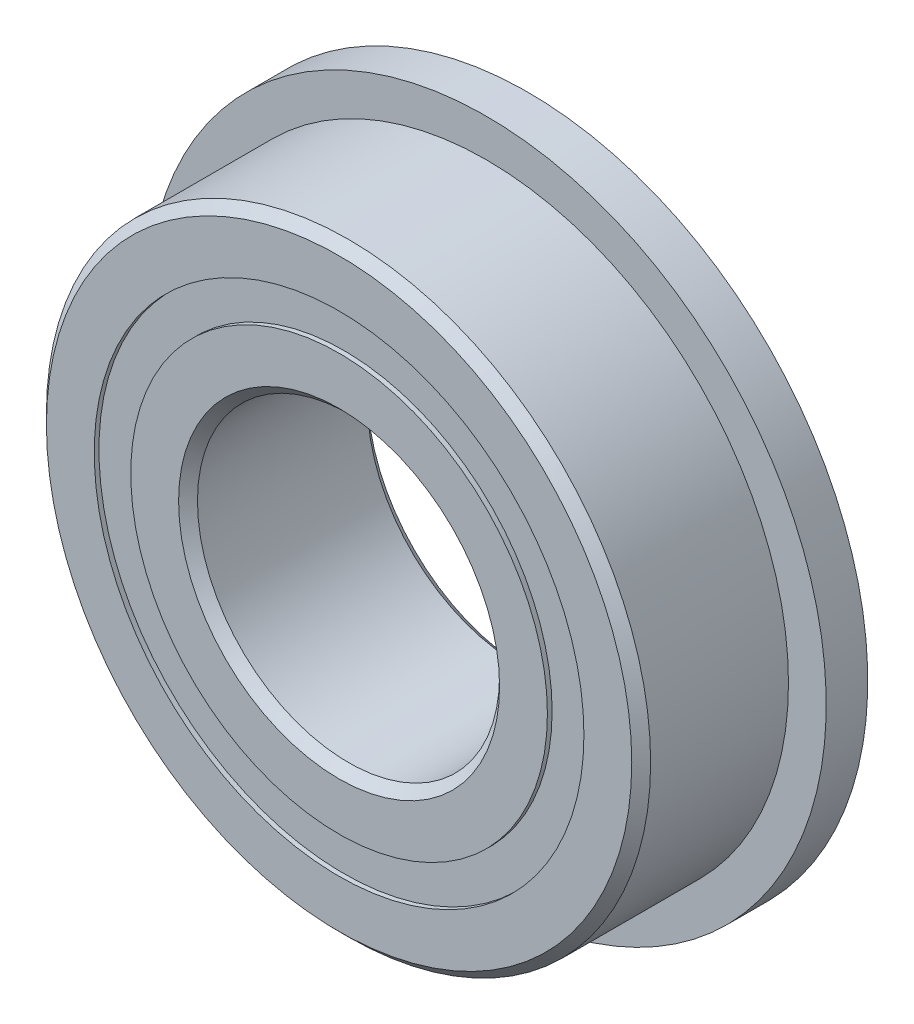
ISO-10303-21;
HEADER;
FILE_DESCRIPTION(('STEP AP214'),'2;1');
FILE_NAME('part.step','',(''),(''),'','','');
FILE_SCHEMA(('AUTOMOTIVE_DESIGN { 1 0 10303 214 1 1 1 1 }'));
ENDSEC;
DATA;
#1=APPLICATION_CONTEXT('core data for automotive mechanical design processes');
#2=APPLICATION_PROTOCOL_DEFINITION('international standard','automotive_design',2000,#1);
#3=PRODUCT_CONTEXT('',#1,'mechanical');
#4=PRODUCT('Part','Part','',(#3));
#5=PRODUCT_RELATED_PRODUCT_CATEGORY('part','',(#4));
#6=PRODUCT_DEFINITION_FORMATION('','',#4);
#7=PRODUCT_DEFINITION_CONTEXT('part definition',#1,'design');
#8=PRODUCT_DEFINITION('design','',#6,#7);
#9=PRODUCT_DEFINITION_SHAPE('','',#8);
#10=(LENGTH_UNIT() NAMED_UNIT(*) SI_UNIT(.MILLI.,.METRE.));
#11=(NAMED_UNIT(*) PLANE_ANGLE_UNIT() SI_UNIT($,.RADIAN.));
#12=(NAMED_UNIT(*) SI_UNIT($,.STERADIAN.) SOLID_ANGLE_UNIT());
#13=UNCERTAINTY_MEASURE_WITH_UNIT(LENGTH_MEASURE(1.E-05),#10,'distance_accuracy_value','');
#14=(GEOMETRIC_REPRESENTATION_CONTEXT(3) GLOBAL_UNCERTAINTY_ASSIGNED_CONTEXT((#13)) GLOBAL_UNIT_ASSIGNED_CONTEXT((#10,
#11,#12)) REPRESENTATION_CONTEXT('',''));
#15=CARTESIAN_POINT('',(0.,0.,0.));
#16=DIRECTION('',(0.,0.,1.));
#17=DIRECTION('',(1.,0.,0.));
#18=AXIS2_PLACEMENT_3D('',#15,#16,#17);
#19=CARTESIAN_POINT('',(0.,6.48351648351649,-2.375));
#20=DIRECTION('',(0.,0.,1.));
#21=DIRECTION('',(1.,0.,0.));
#22=AXIS2_PLACEMENT_3D('',#19,#20,#21);
#23=PLANE('',#22);
#24=CARTESIAN_POINT('',(0.,0.,-2.375));
#25=DIRECTION('',(0.,0.,1.));
#26=DIRECTION('',(1.,0.,0.));
#27=AXIS2_PLACEMENT_3D('',#24,#25,#26);
#28=CIRCLE('',#27,6.48351648351649);
#29=CARTESIAN_POINT('',(6.48351648351649,0.,-2.375));
#30=VERTEX_POINT('',#29);
#31=EDGE_CURVE('E63',#30,#30,#28,.T.);
#32=ORIENTED_EDGE('',*,*,#31,.F.);
#33=EDGE_LOOP('',(#32));
#34=FACE_BOUND('',#33,.T.);
#35=CARTESIAN_POINT('',(0.,0.,-2.375));
#36=DIRECTION('',(0.,0.,1.));
#37=DIRECTION('',(1.,0.,0.));
#38=AXIS2_PLACEMENT_3D('',#35,#36,#37);
#39=CIRCLE('',#38,5.51648351648352);
#40=CARTESIAN_POINT('',(5.51648351648352,0.,-2.375));
#41=VERTEX_POINT('',#40);
#42=EDGE_CURVE('E11',#41,#41,#39,.T.);
#43=ORIENTED_EDGE('',*,*,#42,.T.);
#44=EDGE_LOOP('',(#43));
#45=FACE_BOUND('',#44,.T.);
#46=ADVANCED_FACE('F49',(#34,#45),#23,.F.);
#47=CARTESIAN_POINT('',(0.,0.,2.5));
#48=DIRECTION('',(0.,0.,1.));
#49=DIRECTION('',(1.,0.,0.));
#50=AXIS2_PLACEMENT_3D('',#47,#48,#49);
#51=CYLINDRICAL_SURFACE('',#50,5.51648351648352);
#52=ORIENTED_EDGE('',*,*,#42,.F.);
#53=EDGE_LOOP('',(#52));
#54=FACE_BOUND('',#53,.T.);
#55=CARTESIAN_POINT('',(0.,0.,-1.21175743903915));
#56=DIRECTION('',(0.,0.,1.));
#57=DIRECTION('',(1.,0.,0.));
#58=AXIS2_PLACEMENT_3D('',#55,#56,#57);
#59=CIRCLE('',#58,5.51648351648352);
#60=CARTESIAN_POINT('',(5.51648351648352,0.,-1.21175743903915));
#61=VERTEX_POINT('',#60);
#62=EDGE_CURVE('E55',#61,#61,#59,.T.);
#63=ORIENTED_EDGE('',*,*,#62,.T.);
#64=EDGE_LOOP('',(#63));
#65=FACE_BOUND('',#64,.T.);
#66=ADVANCED_FACE('F72',(#54,#65),#51,.F.);
#67=CARTESIAN_POINT('',(0.,6.48351648351648,-1.21175743903915));
#68=DIRECTION('',(0.,0.,-1.));
#69=DIRECTION('',(-1.,0.,0.));
#70=AXIS2_PLACEMENT_3D('',#67,#68,#69);
#71=PLANE('',#70);
#72=ORIENTED_EDGE('',*,*,#62,.F.);
#73=EDGE_LOOP('',(#72));
#74=FACE_BOUND('',#73,.T.);
#75=CARTESIAN_POINT('',(0.,0.,-1.21175743903915));
#76=DIRECTION('',(0.,0.,1.));
#77=DIRECTION('',(1.,0.,0.));
#78=AXIS2_PLACEMENT_3D('',#75,#76,#77);
#79=CIRCLE('',#78,6.48351648351648);
#80=CARTESIAN_POINT('',(6.48351648351648,0.,-1.21175743903915));
#81=VERTEX_POINT('',#80);
#82=EDGE_CURVE('E59',#81,#81,#79,.T.);
#83=ORIENTED_EDGE('',*,*,#82,.T.);
#84=EDGE_LOOP('',(#83));
#85=FACE_BOUND('',#84,.T.);
#86=ADVANCED_FACE('F76',(#74,#85),#71,.F.);
#87=CARTESIAN_POINT('',(0.,0.,2.5));
#88=DIRECTION('',(0.,0.,1.));
#89=DIRECTION('',(1.,0.,0.));
#90=AXIS2_PLACEMENT_3D('',#87,#88,#89);
#91=CYLINDRICAL_SURFACE('',#90,6.48351648351649);
#92=ORIENTED_EDGE('',*,*,#82,.F.);
#93=EDGE_LOOP('',(#92));
#94=FACE_BOUND('',#93,.T.);
#95=ORIENTED_EDGE('',*,*,#31,.T.);
#96=EDGE_LOOP('',(#95));
#97=FACE_BOUND('',#96,.T.);
#98=ADVANCED_FACE('F69',(#94,#97),#91,.T.);
#99=CLOSED_SHELL('',(#46,#66,#86,#98));
#100=MANIFOLD_SOLID_BREP('B2',#99);
#101=CARTESIAN_POINT('',(0.,6.48351648351648,2.375));
#102=DIRECTION('',(0.,0.,-1.));
#103=DIRECTION('',(-1.,0.,0.));
#104=AXIS2_PLACEMENT_3D('',#101,#102,#103);
#105=PLANE('',#104);
#106=CARTESIAN_POINT('',(0.,0.,2.375));
#107=DIRECTION('',(0.,0.,1.));
#108=DIRECTION('',(1.,0.,0.));
#109=AXIS2_PLACEMENT_3D('',#106,#107,#108);
#110=CIRCLE('',#109,5.51648351648352);
#111=CARTESIAN_POINT('',(5.51648351648352,0.,2.375));
#112=VERTEX_POINT('',#111);
#113=EDGE_CURVE('E48',#112,#112,#110,.T.);
#114=ORIENTED_EDGE('',*,*,#113,.F.);
#115=EDGE_LOOP('',(#114));
#116=FACE_BOUND('',#115,.T.);
#117=CARTESIAN_POINT('',(0.,0.,2.375));
#118=DIRECTION('',(0.,0.,1.));
#119=DIRECTION('',(1.,0.,0.));
#120=AXIS2_PLACEMENT_3D('',#117,#118,#119);
#121=CIRCLE('',#120,6.48351648351648);
#122=CARTESIAN_POINT('',(6.48351648351648,0.,2.375));
#123=VERTEX_POINT('',#122);
#124=EDGE_CURVE('E136',#123,#123,#121,.T.);
#125=ORIENTED_EDGE('',*,*,#124,.T.);
#126=EDGE_LOOP('',(#125));
#127=FACE_BOUND('',#126,.T.);
#128=ADVANCED_FACE('F122',(#116,#127),#105,.F.);
#129=CARTESIAN_POINT('',(0.,0.,2.5));
#130=DIRECTION('',(0.,0.,1.));
#131=DIRECTION('',(1.,0.,0.));
#132=AXIS2_PLACEMENT_3D('',#129,#130,#131);
#133=CYLINDRICAL_SURFACE('',#132,5.51648351648352);
#134=CARTESIAN_POINT('',(0.,0.,1.21175743903915));
#135=DIRECTION('',(0.,0.,1.));
#136=DIRECTION('',(1.,0.,0.));
#137=AXIS2_PLACEMENT_3D('',#134,#135,#136);
#138=CIRCLE('',#137,5.51648351648352);
#139=CARTESIAN_POINT('',(5.51648351648352,0.,1.21175743903915));
#140=VERTEX_POINT('',#139);
#141=EDGE_CURVE('E128',#140,#140,#138,.T.);
#142=ORIENTED_EDGE('',*,*,#141,.F.);
#143=EDGE_LOOP('',(#142));
#144=FACE_BOUND('',#143,.T.);
#145=ORIENTED_EDGE('',*,*,#113,.T.);
#146=EDGE_LOOP('',(#145));
#147=FACE_BOUND('',#146,.T.);
#148=ADVANCED_FACE('F151',(#144,#147),#133,.F.);
#149=CARTESIAN_POINT('',(0.,6.48351648351648,1.21175743903915));
#150=DIRECTION('',(0.,0.,1.));
#151=DIRECTION('',(1.,0.,0.));
#152=AXIS2_PLACEMENT_3D('',#149,#150,#151);
#153=PLANE('',#152);
#154=CARTESIAN_POINT('',(0.,0.,1.21175743903915));
#155=DIRECTION('',(0.,0.,1.));
#156=DIRECTION('',(1.,0.,0.));
#157=AXIS2_PLACEMENT_3D('',#154,#155,#156);
#158=CIRCLE('',#157,6.48351648351648);
#159=CARTESIAN_POINT('',(6.48351648351648,0.,1.21175743903915));
#160=VERTEX_POINT('',#159);
#161=EDGE_CURVE('E132',#160,#160,#158,.T.);
#162=ORIENTED_EDGE('',*,*,#161,.F.);
#163=EDGE_LOOP('',(#162));
#164=FACE_BOUND('',#163,.T.);
#165=ORIENTED_EDGE('',*,*,#141,.T.);
#166=EDGE_LOOP('',(#165));
#167=FACE_BOUND('',#166,.T.);
#168=ADVANCED_FACE('F146',(#164,#167),#153,.F.);
#169=CARTESIAN_POINT('',(0.,0.,2.5));
#170=DIRECTION('',(0.,0.,1.));
#171=DIRECTION('',(1.,0.,0.));
#172=AXIS2_PLACEMENT_3D('',#169,#170,#171);
#173=CYLINDRICAL_SURFACE('',#172,6.48351648351648);
#174=ORIENTED_EDGE('',*,*,#124,.F.);
#175=EDGE_LOOP('',(#174));
#176=FACE_BOUND('',#175,.T.);
#177=ORIENTED_EDGE('',*,*,#161,.T.);
#178=EDGE_LOOP('',(#177));
#179=FACE_BOUND('',#178,.T.);
#180=ADVANCED_FACE('F143',(#176,#179),#173,.T.);
#181=CLOSED_SHELL('',(#128,#148,#168,#180));
#182=MANIFOLD_SOLID_BREP('B6',#181);
#183=CARTESIAN_POINT('',(-2.99999999999993,5.19615242270667,0.));
#184=DIRECTION('',(0.,0.,1.));
#185=DIRECTION('',(-0.499999999999989,0.866025403784445,0.));
#186=AXIS2_PLACEMENT_3D('',#183,#184,#185);
#187=SPHERICAL_SURFACE('',#186,1.21175743903915);
#188=CARTESIAN_POINT('',(-2.99999999999993,5.19615242270667,1.21175743903915));
#189=VERTEX_POINT('',#188);
#190=VERTEX_LOOP('',#189);
#191=FACE_BOUND('',#190,.T.);
#192=ADVANCED_FACE('F189',(#191),#187,.T.);
#193=CLOSED_SHELL('',(#192));
#194=MANIFOLD_SOLID_BREP('B43',#193);
#195=CARTESIAN_POINT('',(-5.1961524227066,3.00000000000006,0.));
#196=DIRECTION('',(0.,0.,1.));
#197=DIRECTION('',(-0.866025403784433,0.50000000000001,0.));
#198=AXIS2_PLACEMENT_3D('',#195,#196,#197);
#199=SPHERICAL_SURFACE('',#198,1.21175743903915);
#200=CARTESIAN_POINT('',(-5.1961524227066,3.00000000000006,1.21175743903915));
#201=VERTEX_POINT('',#200);
#202=VERTEX_LOOP('',#201);
#203=FACE_BOUND('',#202,.T.);
#204=ADVANCED_FACE('F209',(#203),#199,.T.);
#205=CLOSED_SHELL('',(#204));
#206=MANIFOLD_SOLID_BREP('B118',#205);
#207=CARTESIAN_POINT('',(-6.,0.,0.));
#208=DIRECTION('',(0.,0.,1.));
#209=DIRECTION('',(-1.,0.,0.));
#210=AXIS2_PLACEMENT_3D('',#207,#208,#209);
#211=SPHERICAL_SURFACE('',#210,1.21175743903915);
#212=CARTESIAN_POINT('',(-6.,0.,1.21175743903915));
#213=VERTEX_POINT('',#212);
#214=VERTEX_LOOP('',#213);
#215=FACE_BOUND('',#214,.T.);
#216=ADVANCED_FACE('F229',(#215),#211,.T.);
#217=CLOSED_SHELL('',(#216));
#218=MANIFOLD_SOLID_BREP('B185',#217);
#219=CARTESIAN_POINT('',(-5.19615242270666,-2.99999999999995,0.));
#220=DIRECTION('',(0.,0.,1.));
#221=DIRECTION('',(-0.866025403784443,-0.499999999999992,0.));
#222=AXIS2_PLACEMENT_3D('',#219,#220,#221);
#223=SPHERICAL_SURFACE('',#222,1.21175743903915);
#224=CARTESIAN_POINT('',(-5.19615242270666,-2.99999999999995,1.21175743903915));
#225=VERTEX_POINT('',#224);
#226=VERTEX_LOOP('',#225);
#227=FACE_BOUND('',#226,.T.);
#228=ADVANCED_FACE('F249',(#227),#223,.T.);
#229=CLOSED_SHELL('',(#228));
#230=MANIFOLD_SOLID_BREP('B205',#229);
#231=CARTESIAN_POINT('',(-3.00000000000004,-5.19615242270661,0.));
#232=DIRECTION('',(0.,0.,1.));
#233=DIRECTION('',(-0.500000000000007,-0.866025403784435,0.));
#234=AXIS2_PLACEMENT_3D('',#231,#232,#233);
#235=SPHERICAL_SURFACE('',#234,1.21175743903915);
#236=CARTESIAN_POINT('',(-3.00000000000004,-5.19615242270661,1.21175743903915));
#237=VERTEX_POINT('',#236);
#238=VERTEX_LOOP('',#237);
#239=FACE_BOUND('',#238,.T.);
#240=ADVANCED_FACE('F269',(#239),#235,.T.);
#241=CLOSED_SHELL('',(#240));
#242=MANIFOLD_SOLID_BREP('B225',#241);
#243=CARTESIAN_POINT('',(0.,-6.,0.));
#244=DIRECTION('',(0.,0.,1.));
#245=DIRECTION('',(0.,-1.,0.));
#246=AXIS2_PLACEMENT_3D('',#243,#244,#245);
#247=SPHERICAL_SURFACE('',#246,1.21175743903915);
#248=CARTESIAN_POINT('',(0.,-6.,1.21175743903915));
#249=VERTEX_POINT('',#248);
#250=VERTEX_LOOP('',#249);
#251=FACE_BOUND('',#250,.T.);
#252=ADVANCED_FACE('F289',(#251),#247,.T.);
#253=CLOSED_SHELL('',(#252));
#254=MANIFOLD_SOLID_BREP('B245',#253);
#255=CARTESIAN_POINT('',(2.99999999999997,-5.19615242270665,0.));
#256=DIRECTION('',(0.,0.,1.));
#257=DIRECTION('',(0.499999999999995,-0.866025403784442,0.));
#258=AXIS2_PLACEMENT_3D('',#255,#256,#257);
#259=SPHERICAL_SURFACE('',#258,1.21175743903915);
#260=CARTESIAN_POINT('',(2.99999999999997,-5.19615242270665,1.21175743903915));
#261=VERTEX_POINT('',#260);
#262=VERTEX_LOOP('',#261);
#263=FACE_BOUND('',#262,.T.);
#264=ADVANCED_FACE('F309',(#263),#259,.T.);
#265=CLOSED_SHELL('',(#264));
#266=MANIFOLD_SOLID_BREP('B265',#265);
#267=CARTESIAN_POINT('',(5.19615242270662,-3.00000000000002,0.));
#268=DIRECTION('',(0.,0.,1.));
#269=DIRECTION('',(0.866025403784436,-0.500000000000004,0.));
#270=AXIS2_PLACEMENT_3D('',#267,#268,#269);
#271=SPHERICAL_SURFACE('',#270,1.21175743903915);
#272=CARTESIAN_POINT('',(5.19615242270662,-3.00000000000002,1.21175743903915));
#273=VERTEX_POINT('',#272);
#274=VERTEX_LOOP('',#273);
#275=FACE_BOUND('',#274,.T.);
#276=ADVANCED_FACE('F329',(#275),#271,.T.);
#277=CLOSED_SHELL('',(#276));
#278=MANIFOLD_SOLID_BREP('B285',#277);
#279=CARTESIAN_POINT('',(6.,0.,0.));
#280=DIRECTION('',(0.,0.,1.));
#281=DIRECTION('',(1.,0.,0.));
#282=AXIS2_PLACEMENT_3D('',#279,#280,#281);
#283=SPHERICAL_SURFACE('',#282,1.21175743903915);
#284=CARTESIAN_POINT('',(6.,0.,1.21175743903915));
#285=VERTEX_POINT('',#284);
#286=VERTEX_LOOP('',#285);
#287=FACE_BOUND('',#286,.T.);
#288=ADVANCED_FACE('F349',(#287),#283,.T.);
#289=CLOSED_SHELL('',(#288));
#290=MANIFOLD_SOLID_BREP('B305',#289);
#291=CARTESIAN_POINT('',(5.19615242270664,2.99999999999999,0.));
#292=DIRECTION('',(0.,0.,1.));
#293=DIRECTION('',(0.86602540378444,0.499999999999998,0.));
#294=AXIS2_PLACEMENT_3D('',#291,#292,#293);
#295=SPHERICAL_SURFACE('',#294,1.21175743903915);
#296=CARTESIAN_POINT('',(5.19615242270664,2.99999999999999,1.21175743903915));
#297=VERTEX_POINT('',#296);
#298=VERTEX_LOOP('',#297);
#299=FACE_BOUND('',#298,.T.);
#300=ADVANCED_FACE('F369',(#299),#295,.T.);
#301=CLOSED_SHELL('',(#300));
#302=MANIFOLD_SOLID_BREP('B325',#301);
#303=CARTESIAN_POINT('',(3.00000000000001,5.19615242270663,0.));
#304=DIRECTION('',(0.,0.,1.));
#305=DIRECTION('',(0.500000000000001,0.866025403784438,0.));
#306=AXIS2_PLACEMENT_3D('',#303,#304,#305);
#307=SPHERICAL_SURFACE('',#306,1.21175743903915);
#308=CARTESIAN_POINT('',(3.00000000000001,5.19615242270663,1.21175743903915));
#309=VERTEX_POINT('',#308);
#310=VERTEX_LOOP('',#309);
#311=FACE_BOUND('',#310,.T.);
#312=ADVANCED_FACE('F389',(#311),#307,.T.);
#313=CLOSED_SHELL('',(#312));
#314=MANIFOLD_SOLID_BREP('B345',#313);
#315=CARTESIAN_POINT('',(0.,6.,0.));
#316=DIRECTION('',(0.,0.,1.));
#317=DIRECTION('',(0.,1.,0.));
#318=AXIS2_PLACEMENT_3D('',#315,#316,#317);
#319=SPHERICAL_SURFACE('',#318,1.21175743903915);
#320=CARTESIAN_POINT('',(0.,6.,1.21175743903915));
#321=VERTEX_POINT('',#320);
#322=VERTEX_LOOP('',#321);
#323=FACE_BOUND('',#322,.T.);
#324=ADVANCED_FACE('F411',(#323),#319,.T.);
#325=CLOSED_SHELL('',(#324));
#326=MANIFOLD_SOLID_BREP('B365',#325);
#327=CARTESIAN_POINT('',(0.,5.51648351648352,2.5));
#328=DIRECTION('',(0.,0.,-1.));
#329=DIRECTION('',(-1.,0.,0.));
#330=AXIS2_PLACEMENT_3D('',#327,#328,#329);
#331=PLANE('',#330);
#332=CARTESIAN_POINT('',(0.,0.,2.5));
#333=DIRECTION('',(0.,0.,1.));
#334=DIRECTION('',(1.,0.,0.));
#335=AXIS2_PLACEMENT_3D('',#332,#333,#334);
#336=CIRCLE('',#335,4.25);
#337=CARTESIAN_POINT('',(4.25,0.,2.5));
#338=VERTEX_POINT('',#337);
#339=EDGE_CURVE('E460',#338,#338,#336,.T.);
#340=ORIENTED_EDGE('',*,*,#339,.F.);
#341=EDGE_LOOP('',(#340));
#342=FACE_BOUND('',#341,.T.);
#343=CARTESIAN_POINT('',(0.,0.,2.5));
#344=DIRECTION('',(0.,0.,1.));
#345=DIRECTION('',(1.,0.,0.));
#346=AXIS2_PLACEMENT_3D('',#343,#344,#345);
#347=CIRCLE('',#346,5.51648351648352);
#348=CARTESIAN_POINT('',(5.51648351648352,0.,2.5));
#349=VERTEX_POINT('',#348);
#350=EDGE_CURVE('E410',#349,#349,#347,.T.);
#351=ORIENTED_EDGE('',*,*,#350,.T.);
#352=EDGE_LOOP('',(#351));
#353=FACE_BOUND('',#352,.T.);
#354=ADVANCED_FACE('F432',(#342,#353),#331,.F.);
#355=CARTESIAN_POINT('',(0.,0.,2.5));
#356=DIRECTION('',(0.,0.,1.));
#357=DIRECTION('',(1.,0.,0.));
#358=AXIS2_PLACEMENT_3D('',#355,#356,#357);
#359=CYLINDRICAL_SURFACE('',#358,5.51648351648352);
#360=ORIENTED_EDGE('',*,*,#350,.F.);
#361=EDGE_LOOP('',(#360));
#362=FACE_BOUND('',#361,.T.);
#363=CARTESIAN_POINT('',(0.,0.,1.11111111111111));
#364=DIRECTION('',(0.,0.,1.));
#365=DIRECTION('',(1.,0.,0.));
#366=AXIS2_PLACEMENT_3D('',#363,#364,#365);
#367=CIRCLE('',#366,5.51648351648352);
#368=CARTESIAN_POINT('',(5.51648351648352,0.,1.11111111111111));
#369=VERTEX_POINT('',#368);
#370=EDGE_CURVE('E438',#369,#369,#367,.T.);
#371=ORIENTED_EDGE('',*,*,#370,.T.);
#372=EDGE_LOOP('',(#371));
#373=FACE_BOUND('',#372,.T.);
#374=ADVANCED_FACE('F467',(#362,#373),#359,.T.);
#375=CARTESIAN_POINT('',(0.,0.,0.));
#376=DIRECTION('',(0.,0.,1.));
#377=DIRECTION('',(1.,0.,0.));
#378=AXIS2_PLACEMENT_3D('',#375,#376,#377);
#379=TOROIDAL_SURFACE('',#378,6.,1.21175743903915);
#380=ORIENTED_EDGE('',*,*,#370,.F.);
#381=EDGE_LOOP('',(#380));
#382=FACE_BOUND('',#381,.T.);
#383=CARTESIAN_POINT('',(0.,0.,-1.11111111111111));
#384=DIRECTION('',(0.,0.,1.));
#385=DIRECTION('',(1.,0.,0.));
#386=AXIS2_PLACEMENT_3D('',#383,#384,#385);
#387=CIRCLE('',#386,5.51648351648352);
#388=CARTESIAN_POINT('',(5.51648351648352,0.,-1.11111111111111));
#389=VERTEX_POINT('',#388);
#390=EDGE_CURVE('E442',#389,#389,#387,.T.);
#391=ORIENTED_EDGE('',*,*,#390,.T.);
#392=EDGE_LOOP('',(#391));
#393=FACE_BOUND('',#392,.T.);
#394=ADVANCED_FACE('F471',(#382,#393),#379,.F.);
#395=CARTESIAN_POINT('',(0.,0.,2.5));
#396=DIRECTION('',(0.,0.,1.));
#397=DIRECTION('',(1.,0.,0.));
#398=AXIS2_PLACEMENT_3D('',#395,#396,#397);
#399=CYLINDRICAL_SURFACE('',#398,5.51648351648352);
#400=ORIENTED_EDGE('',*,*,#390,.F.);
#401=EDGE_LOOP('',(#400));
#402=FACE_BOUND('',#401,.T.);
#403=CARTESIAN_POINT('',(0.,0.,-2.5));
#404=DIRECTION('',(0.,0.,1.));
#405=DIRECTION('',(1.,0.,0.));
#406=AXIS2_PLACEMENT_3D('',#403,#404,#405);
#407=CIRCLE('',#406,5.51648351648352);
#408=CARTESIAN_POINT('',(5.51648351648352,0.,-2.5));
#409=VERTEX_POINT('',#408);
#410=EDGE_CURVE('E446',#409,#409,#407,.T.);
#411=ORIENTED_EDGE('',*,*,#410,.T.);
#412=EDGE_LOOP('',(#411));
#413=FACE_BOUND('',#412,.T.);
#414=ADVANCED_FACE('F476',(#402,#413),#399,.T.);
#415=CARTESIAN_POINT('',(0.,4.25,-2.5));
#416=DIRECTION('',(0.,0.,1.));
#417=DIRECTION('',(1.,0.,0.));
#418=AXIS2_PLACEMENT_3D('',#415,#416,#417);
#419=PLANE('',#418);
#420=ORIENTED_EDGE('',*,*,#410,.F.);
#421=EDGE_LOOP('',(#420));
#422=FACE_BOUND('',#421,.T.);
#423=CARTESIAN_POINT('',(0.,0.,-2.5));
#424=DIRECTION('',(0.,0.,1.));
#425=DIRECTION('',(1.,0.,0.));
#426=AXIS2_PLACEMENT_3D('',#423,#424,#425);
#427=CIRCLE('',#426,4.25);
#428=CARTESIAN_POINT('',(4.25,0.,-2.5));
#429=VERTEX_POINT('',#428);
#430=EDGE_CURVE('E451',#429,#429,#427,.T.);
#431=ORIENTED_EDGE('',*,*,#430,.T.);
#432=EDGE_LOOP('',(#431));
#433=FACE_BOUND('',#432,.T.);
#434=ADVANCED_FACE('F482',(#422,#433),#419,.F.);
#435=CARTESIAN_POINT('',(0.,0.,-2.25));
#436=DIRECTION('',(0.,0.,-1.));
#437=DIRECTION('',(-1.,0.,0.));
#438=AXIS2_PLACEMENT_3D('',#435,#436,#437);
#439=CONICAL_SURFACE('',#438,4.,0.785398163397443);
#440=ORIENTED_EDGE('',*,*,#430,.F.);
#441=EDGE_LOOP('',(#440));
#442=FACE_BOUND('',#441,.T.);
#443=CARTESIAN_POINT('',(0.,0.,-2.25));
#444=DIRECTION('',(0.,0.,1.));
#445=DIRECTION('',(1.,0.,0.));
#446=AXIS2_PLACEMENT_3D('',#443,#444,#445);
#447=CIRCLE('',#446,4.);
#448=CARTESIAN_POINT('',(4.,0.,-2.25));
#449=VERTEX_POINT('',#448);
#450=EDGE_CURVE('E454',#449,#449,#447,.T.);
#451=ORIENTED_EDGE('',*,*,#450,.T.);
#452=EDGE_LOOP('',(#451));
#453=FACE_BOUND('',#452,.T.);
#454=ADVANCED_FACE('F486',(#442,#453),#439,.F.);
#455=CARTESIAN_POINT('',(0.,0.,2.5));
#456=DIRECTION('',(0.,0.,1.));
#457=DIRECTION('',(1.,0.,0.));
#458=AXIS2_PLACEMENT_3D('',#455,#456,#457);
#459=CYLINDRICAL_SURFACE('',#458,4.);
#460=ORIENTED_EDGE('',*,*,#450,.F.);
#461=EDGE_LOOP('',(#460));
#462=FACE_BOUND('',#461,.T.);
#463=CARTESIAN_POINT('',(0.,0.,2.25));
#464=DIRECTION('',(0.,0.,1.));
#465=DIRECTION('',(1.,0.,0.));
#466=AXIS2_PLACEMENT_3D('',#463,#464,#465);
#467=CIRCLE('',#466,4.);
#468=CARTESIAN_POINT('',(4.,0.,2.25));
#469=VERTEX_POINT('',#468);
#470=EDGE_CURVE('E457',#469,#469,#467,.T.);
#471=ORIENTED_EDGE('',*,*,#470,.T.);
#472=EDGE_LOOP('',(#471));
#473=FACE_BOUND('',#472,.T.);
#474=ADVANCED_FACE('F490',(#462,#473),#459,.F.);
#475=CARTESIAN_POINT('',(0.,0.,2.5));
#476=DIRECTION('',(0.,0.,1.));
#477=DIRECTION('',(1.,0.,0.));
#478=AXIS2_PLACEMENT_3D('',#475,#476,#477);
#479=CONICAL_SURFACE('',#478,4.25,0.785398163397453);
#480=ORIENTED_EDGE('',*,*,#470,.F.);
#481=EDGE_LOOP('',(#480));
#482=FACE_BOUND('',#481,.T.);
#483=ORIENTED_EDGE('',*,*,#339,.T.);
#484=EDGE_LOOP('',(#483));
#485=FACE_BOUND('',#484,.T.);
#486=ADVANCED_FACE('F464',(#482,#485),#479,.F.);
#487=CLOSED_SHELL('',(#354,#374,#394,#414,#434,#454,#474,#486));
#488=MANIFOLD_SOLID_BREP('B385',#487);
#489=CARTESIAN_POINT('',(0.,0.,2.25));
#490=DIRECTION('',(0.,0.,-1.));
#491=DIRECTION('',(-1.,0.,0.));
#492=AXIS2_PLACEMENT_3D('',#489,#490,#491);
#493=CONICAL_SURFACE('',#492,8.,0.785398163397446);
#494=CARTESIAN_POINT('',(0.,0.,2.5));
#495=DIRECTION('',(0.,0.,1.));
#496=DIRECTION('',(1.,0.,0.));
#497=AXIS2_PLACEMENT_3D('',#494,#495,#496);
#498=CIRCLE('',#497,7.75);
#499=CARTESIAN_POINT('',(7.75,0.,2.5));
#500=VERTEX_POINT('',#499);
#501=EDGE_CURVE('E581',#500,#500,#498,.T.);
#502=ORIENTED_EDGE('',*,*,#501,.F.);
#503=EDGE_LOOP('',(#502));
#504=FACE_BOUND('',#503,.T.);
#505=CARTESIAN_POINT('',(0.,0.,2.25));
#506=DIRECTION('',(0.,0.,1.));
#507=DIRECTION('',(1.,0.,0.));
#508=AXIS2_PLACEMENT_3D('',#505,#506,#507);
#509=CIRCLE('',#508,8.);
#510=CARTESIAN_POINT('',(8.,0.,2.25));
#511=VERTEX_POINT('',#510);
#512=EDGE_CURVE('E431',#511,#511,#509,.T.);
#513=ORIENTED_EDGE('',*,*,#512,.T.);
#514=EDGE_LOOP('',(#513));
#515=FACE_BOUND('',#514,.T.);
#516=ADVANCED_FACE('F559',(#504,#515),#493,.T.);
#517=CARTESIAN_POINT('',(0.,0.,2.5));
#518=DIRECTION('',(0.,0.,1.));
#519=DIRECTION('',(1.,0.,0.));
#520=AXIS2_PLACEMENT_3D('',#517,#518,#519);
#521=CYLINDRICAL_SURFACE('',#520,8.);
#522=CARTESIAN_POINT('',(0.,0.,-1.4));
#523=DIRECTION('',(0.,0.,1.));
#524=DIRECTION('',(1.,0.,0.));
#525=AXIS2_PLACEMENT_3D('',#522,#523,#524);
#526=CIRCLE('',#525,8.);
#527=CARTESIAN_POINT('',(8.,0.,-1.4));
#528=VERTEX_POINT('',#527);
#529=EDGE_CURVE('E584',#528,#528,#526,.T.);
#530=ORIENTED_EDGE('',*,*,#529,.T.);
#531=EDGE_LOOP('',(#530));
#532=FACE_BOUND('',#531,.T.);
#533=ORIENTED_EDGE('',*,*,#512,.F.);
#534=EDGE_LOOP('',(#533));
#535=FACE_BOUND('',#534,.T.);
#536=ADVANCED_FACE('F604',(#532,#535),#521,.T.);
#537=CARTESIAN_POINT('',(0.,7.75,-2.5));
#538=DIRECTION('',(0.,0.,1.));
#539=DIRECTION('',(1.,0.,0.));
#540=AXIS2_PLACEMENT_3D('',#537,#538,#539);
#541=PLANE('',#540);
#542=CARTESIAN_POINT('',(0.,0.,-2.5));
#543=DIRECTION('',(0.,0.,1.));
#544=DIRECTION('',(1.,0.,0.));
#545=AXIS2_PLACEMENT_3D('',#542,#543,#544);
#546=CIRCLE('',#545,6.48351648351648);
#547=CARTESIAN_POINT('',(6.48351648351648,0.,-2.5));
#548=VERTEX_POINT('',#547);
#549=EDGE_CURVE('E565',#548,#548,#546,.T.);
#550=ORIENTED_EDGE('',*,*,#549,.T.);
#551=EDGE_LOOP('',(#550));
#552=FACE_BOUND('',#551,.T.);
#553=CARTESIAN_POINT('',(0.,0.,-2.5));
#554=DIRECTION('',(0.,0.,-1.));
#555=DIRECTION('',(-1.,0.,0.));
#556=AXIS2_PLACEMENT_3D('',#553,#554,#555);
#557=CIRCLE('',#556,9.);
#558=CARTESIAN_POINT('',(-9.,0.,-2.5));
#559=VERTEX_POINT('',#558);
#560=EDGE_CURVE('E587',#559,#559,#557,.T.);
#561=ORIENTED_EDGE('',*,*,#560,.T.);
#562=EDGE_LOOP('',(#561));
#563=FACE_BOUND('',#562,.T.);
#564=ADVANCED_FACE('F607',(#552,#563),#541,.F.);
#565=CARTESIAN_POINT('',(0.,0.,2.5));
#566=DIRECTION('',(0.,0.,1.));
#567=DIRECTION('',(1.,0.,0.));
#568=AXIS2_PLACEMENT_3D('',#565,#566,#567);
#569=CYLINDRICAL_SURFACE('',#568,6.48351648351648);
#570=CARTESIAN_POINT('',(0.,0.,-1.11111111111111));
#571=DIRECTION('',(0.,0.,1.));
#572=DIRECTION('',(1.,0.,0.));
#573=AXIS2_PLACEMENT_3D('',#570,#571,#572);
#574=CIRCLE('',#573,6.48351648351648);
#575=CARTESIAN_POINT('',(6.48351648351648,0.,-1.11111111111111));
#576=VERTEX_POINT('',#575);
#577=EDGE_CURVE('E569',#576,#576,#574,.T.);
#578=ORIENTED_EDGE('',*,*,#577,.T.);
#579=EDGE_LOOP('',(#578));
#580=FACE_BOUND('',#579,.T.);
#581=ORIENTED_EDGE('',*,*,#549,.F.);
#582=EDGE_LOOP('',(#581));
#583=FACE_BOUND('',#582,.T.);
#584=ADVANCED_FACE('F612',(#580,#583),#569,.F.);
#585=CARTESIAN_POINT('',(0.,0.,0.));
#586=DIRECTION('',(0.,0.,1.));
#587=DIRECTION('',(1.,0.,0.));
#588=AXIS2_PLACEMENT_3D('',#585,#586,#587);
#589=TOROIDAL_SURFACE('',#588,6.,1.21175743903915);
#590=ORIENTED_EDGE('',*,*,#577,.F.);
#591=EDGE_LOOP('',(#590));
#592=FACE_BOUND('',#591,.T.);
#593=CARTESIAN_POINT('',(0.,0.,1.11111111111111));
#594=DIRECTION('',(0.,0.,1.));
#595=DIRECTION('',(1.,0.,0.));
#596=AXIS2_PLACEMENT_3D('',#593,#594,#595);
#597=CIRCLE('',#596,6.48351648351648);
#598=CARTESIAN_POINT('',(6.48351648351648,0.,1.11111111111111));
#599=VERTEX_POINT('',#598);
#600=EDGE_CURVE('E573',#599,#599,#597,.T.);
#601=ORIENTED_EDGE('',*,*,#600,.T.);
#602=EDGE_LOOP('',(#601));
#603=FACE_BOUND('',#602,.T.);
#604=ADVANCED_FACE('F618',(#592,#603),#589,.F.);
#605=CARTESIAN_POINT('',(0.,0.,2.5));
#606=DIRECTION('',(0.,0.,1.));
#607=DIRECTION('',(1.,0.,0.));
#608=AXIS2_PLACEMENT_3D('',#605,#606,#607);
#609=CYLINDRICAL_SURFACE('',#608,6.48351648351648);
#610=ORIENTED_EDGE('',*,*,#600,.F.);
#611=EDGE_LOOP('',(#610));
#612=FACE_BOUND('',#611,.T.);
#613=CARTESIAN_POINT('',(0.,0.,2.5));
#614=DIRECTION('',(0.,0.,1.));
#615=DIRECTION('',(1.,0.,0.));
#616=AXIS2_PLACEMENT_3D('',#613,#614,#615);
#617=CIRCLE('',#616,6.48351648351648);
#618=CARTESIAN_POINT('',(6.48351648351648,0.,2.5));
#619=VERTEX_POINT('',#618);
#620=EDGE_CURVE('E578',#619,#619,#617,.T.);
#621=ORIENTED_EDGE('',*,*,#620,.T.);
#622=EDGE_LOOP('',(#621));
#623=FACE_BOUND('',#622,.T.);
#624=ADVANCED_FACE('F622',(#612,#623),#609,.F.);
#625=CARTESIAN_POINT('',(0.,7.75,2.5));
#626=DIRECTION('',(0.,0.,-1.));
#627=DIRECTION('',(-1.,0.,0.));
#628=AXIS2_PLACEMENT_3D('',#625,#626,#627);
#629=PLANE('',#628);
#630=ORIENTED_EDGE('',*,*,#620,.F.);
#631=EDGE_LOOP('',(#630));
#632=FACE_BOUND('',#631,.T.);
#633=ORIENTED_EDGE('',*,*,#501,.T.);
#634=EDGE_LOOP('',(#633));
#635=FACE_BOUND('',#634,.T.);
#636=ADVANCED_FACE('F600',(#632,#635),#629,.F.);
#637=CARTESIAN_POINT('',(0.,6.48351648351648,-1.4));
#638=DIRECTION('',(0.,0.,1.));
#639=DIRECTION('',(1.,0.,0.));
#640=AXIS2_PLACEMENT_3D('',#637,#638,#639);
#641=PLANE('',#640);
#642=CARTESIAN_POINT('',(0.,0.,-1.4));
#643=DIRECTION('',(0.,0.,-1.));
#644=DIRECTION('',(-1.,0.,0.));
#645=AXIS2_PLACEMENT_3D('',#642,#643,#644);
#646=CIRCLE('',#645,9.);
#647=CARTESIAN_POINT('',(-9.,0.,-1.4));
#648=VERTEX_POINT('',#647);
#649=EDGE_CURVE('E590',#648,#648,#646,.T.);
#650=ORIENTED_EDGE('',*,*,#649,.F.);
#651=EDGE_LOOP('',(#650));
#652=FACE_BOUND('',#651,.T.);
#653=ORIENTED_EDGE('',*,*,#529,.F.);
#654=EDGE_LOOP('',(#653));
#655=FACE_BOUND('',#654,.T.);
#656=ADVANCED_FACE('F597',(#652,#655),#641,.T.);
#657=CARTESIAN_POINT('',(0.,0.,-2.5));
#658=DIRECTION('',(0.,0.,-1.));
#659=DIRECTION('',(-1.,0.,0.));
#660=AXIS2_PLACEMENT_3D('',#657,#658,#659);
#661=CYLINDRICAL_SURFACE('',#660,9.);
#662=ORIENTED_EDGE('',*,*,#649,.T.);
#663=EDGE_LOOP('',(#662));
#664=FACE_BOUND('',#663,.T.);
#665=ORIENTED_EDGE('',*,*,#560,.F.);
#666=EDGE_LOOP('',(#665));
#667=FACE_BOUND('',#666,.T.);
#668=ADVANCED_FACE('F594',(#664,#667),#661,.T.);
#669=CLOSED_SHELL('',(#516,#536,#564,#584,#604,#624,#636,#656,#668));
#670=MANIFOLD_SOLID_BREP('B405',#669);
#671=ADVANCED_BREP_SHAPE_REPRESENTATION('',(#18,#100,#182,#194,#206,#218,#230,#242,#254,#266,
#278,#290,#302,#314,#326,#488,#670),#14);
#672=SHAPE_DEFINITION_REPRESENTATION(#9,#671);
ENDSEC;
END-ISO-10303-21;
